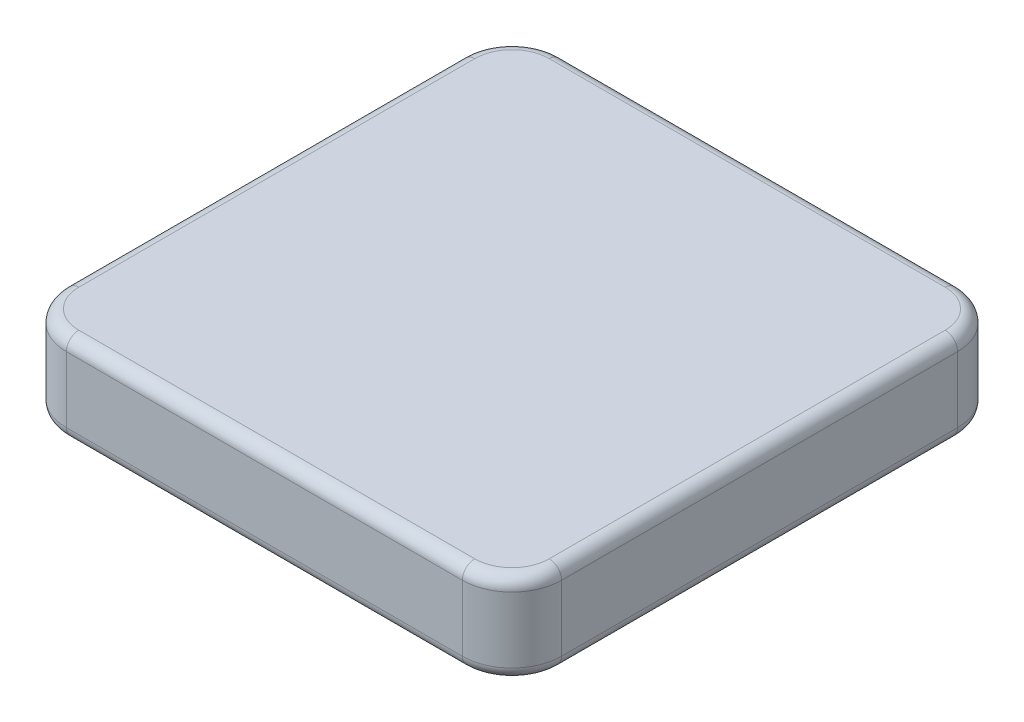
ISO-10303-21;
HEADER;
FILE_DESCRIPTION(('STEP AP214'),'2;1');
FILE_NAME('part.step','',(''),(''),'','','');
FILE_SCHEMA(('AUTOMOTIVE_DESIGN { 1 0 10303 214 1 1 1 1 }'));
ENDSEC;
DATA;
#1=APPLICATION_CONTEXT('core data for automotive mechanical design processes');
#2=APPLICATION_PROTOCOL_DEFINITION('international standard','automotive_design',2000,#1);
#3=PRODUCT_CONTEXT('',#1,'mechanical');
#4=PRODUCT('Part','Part','',(#3));
#5=PRODUCT_RELATED_PRODUCT_CATEGORY('part','',(#4));
#6=PRODUCT_DEFINITION_FORMATION('','',#4);
#7=PRODUCT_DEFINITION_CONTEXT('part definition',#1,'design');
#8=PRODUCT_DEFINITION('design','',#6,#7);
#9=PRODUCT_DEFINITION_SHAPE('','',#8);
#10=(LENGTH_UNIT() NAMED_UNIT(*) SI_UNIT(.MILLI.,.METRE.));
#11=(NAMED_UNIT(*) PLANE_ANGLE_UNIT() SI_UNIT($,.RADIAN.));
#12=(NAMED_UNIT(*) SI_UNIT($,.STERADIAN.) SOLID_ANGLE_UNIT());
#13=UNCERTAINTY_MEASURE_WITH_UNIT(LENGTH_MEASURE(1.E-05),#10,'distance_accuracy_value','');
#14=(GEOMETRIC_REPRESENTATION_CONTEXT(3) GLOBAL_UNCERTAINTY_ASSIGNED_CONTEXT((#13)) GLOBAL_UNIT_ASSIGNED_CONTEXT((#10,
#11,#12)) REPRESENTATION_CONTEXT('',''));
#15=CARTESIAN_POINT('',(0.,0.,0.));
#16=DIRECTION('',(0.,0.,1.));
#17=DIRECTION('',(1.,0.,0.));
#18=AXIS2_PLACEMENT_3D('',#15,#16,#17);
#19=CARTESIAN_POINT('',(4.,7.3,-4.));
#20=DIRECTION('',(0.,-1.,0.));
#21=DIRECTION('',(0.,0.,-1.));
#22=AXIS2_PLACEMENT_3D('',#19,#20,#21);
#23=CYLINDRICAL_SURFACE('',#22,4.);
#24=DIRECTION('',(0.,-1.,0.));
#25=VECTOR('',#24,1.);
#26=CARTESIAN_POINT('',(4.00000000000003,7.3,0.));
#27=LINE('',#26,#25);
#28=CARTESIAN_POINT('',(4.00000000000003,6.3,0.));
#29=VERTEX_POINT('',#28);
#30=CARTESIAN_POINT('',(4.00000000000003,1.,0.));
#31=VERTEX_POINT('',#30);
#32=EDGE_CURVE('E176',#29,#31,#27,.T.);
#33=ORIENTED_EDGE('',*,*,#32,.F.);
#34=CARTESIAN_POINT('',(4.,6.3,-4.));
#35=DIRECTION('',(0.,1.,0.));
#36=DIRECTION('',(0.,0.,1.));
#37=AXIS2_PLACEMENT_3D('',#34,#35,#36);
#38=CIRCLE('',#37,4.);
#39=CARTESIAN_POINT('',(0.,6.3,-4.00000000000003));
#40=VERTEX_POINT('',#39);
#41=EDGE_CURVE('E217',#29,#40,#38,.F.);
#42=ORIENTED_EDGE('',*,*,#41,.T.);
#43=DIRECTION('',(0.,-1.,0.));
#44=VECTOR('',#43,1.);
#45=CARTESIAN_POINT('',(0.,7.3,-4.00000000000003));
#46=LINE('',#45,#44);
#47=CARTESIAN_POINT('',(0.,1.,-4.00000000000003));
#48=VERTEX_POINT('',#47);
#49=EDGE_CURVE('E248',#40,#48,#46,.T.);
#50=ORIENTED_EDGE('',*,*,#49,.T.);
#51=CARTESIAN_POINT('',(4.,1.,-4.));
#52=DIRECTION('',(0.,1.,0.));
#53=DIRECTION('',(0.,0.,1.));
#54=AXIS2_PLACEMENT_3D('',#51,#52,#53);
#55=CIRCLE('',#54,4.);
#56=EDGE_CURVE('E215',#48,#31,#55,.T.);
#57=ORIENTED_EDGE('',*,*,#56,.T.);
#58=EDGE_LOOP('',(#33,#42,#50,#57));
#59=FACE_BOUND('',#58,.T.);
#60=ADVANCED_FACE('F43',(#59),#23,.T.);
#61=CARTESIAN_POINT('',(4.00000000000003,7.3,0.));
#62=DIRECTION('',(0.,0.,-1.));
#63=DIRECTION('',(-1.,0.,0.));
#64=AXIS2_PLACEMENT_3D('',#61,#62,#63);
#65=PLANE('',#64);
#66=DIRECTION('',(0.,-1.,0.));
#67=VECTOR('',#66,1.);
#68=CARTESIAN_POINT('',(35.9,7.3,0.));
#69=LINE('',#68,#67);
#70=CARTESIAN_POINT('',(35.9,6.3,0.));
#71=VERTEX_POINT('',#70);
#72=CARTESIAN_POINT('',(35.9,1.,0.));
#73=VERTEX_POINT('',#72);
#74=EDGE_CURVE('E303',#71,#73,#69,.T.);
#75=ORIENTED_EDGE('',*,*,#74,.F.);
#76=DIRECTION('',(1.,0.,0.));
#77=VECTOR('',#76,1.);
#78=CARTESIAN_POINT('',(4.00000000000003,6.3,0.));
#79=LINE('',#78,#77);
#80=EDGE_CURVE('E213',#71,#29,#79,.F.);
#81=ORIENTED_EDGE('',*,*,#80,.T.);
#82=ORIENTED_EDGE('',*,*,#32,.T.);
#83=DIRECTION('',(1.,0.,0.));
#84=VECTOR('',#83,1.);
#85=CARTESIAN_POINT('',(4.00000000000003,1.,0.));
#86=LINE('',#85,#84);
#87=EDGE_CURVE('E210',#31,#73,#86,.T.);
#88=ORIENTED_EDGE('',*,*,#87,.T.);
#89=EDGE_LOOP('',(#75,#81,#82,#88));
#90=FACE_BOUND('',#89,.T.);
#91=ADVANCED_FACE('F300',(#90),#65,.F.);
#92=CARTESIAN_POINT('',(35.9,7.3,-4.));
#93=DIRECTION('',(0.,-1.,0.));
#94=DIRECTION('',(0.,0.,-1.));
#95=AXIS2_PLACEMENT_3D('',#92,#93,#94);
#96=CYLINDRICAL_SURFACE('',#95,4.);
#97=DIRECTION('',(0.,-1.,0.));
#98=VECTOR('',#97,1.);
#99=CARTESIAN_POINT('',(39.9,7.3,-4.));
#100=LINE('',#99,#98);
#101=CARTESIAN_POINT('',(39.9,6.3,-4.));
#102=VERTEX_POINT('',#101);
#103=CARTESIAN_POINT('',(39.9,1.,-4.));
#104=VERTEX_POINT('',#103);
#105=EDGE_CURVE('E305',#102,#104,#100,.T.);
#106=ORIENTED_EDGE('',*,*,#105,.F.);
#107=CARTESIAN_POINT('',(35.9,6.3,-4.));
#108=DIRECTION('',(0.,1.,0.));
#109=DIRECTION('',(0.,0.,1.));
#110=AXIS2_PLACEMENT_3D('',#107,#108,#109);
#111=CIRCLE('',#110,4.);
#112=EDGE_CURVE('E208',#102,#71,#111,.F.);
#113=ORIENTED_EDGE('',*,*,#112,.T.);
#114=ORIENTED_EDGE('',*,*,#74,.T.);
#115=CARTESIAN_POINT('',(35.9,1.,-4.));
#116=DIRECTION('',(0.,1.,0.));
#117=DIRECTION('',(0.,0.,1.));
#118=AXIS2_PLACEMENT_3D('',#115,#116,#117);
#119=CIRCLE('',#118,4.);
#120=EDGE_CURVE('E206',#73,#104,#119,.T.);
#121=ORIENTED_EDGE('',*,*,#120,.T.);
#122=EDGE_LOOP('',(#106,#113,#114,#121));
#123=FACE_BOUND('',#122,.T.);
#124=ADVANCED_FACE('F373',(#123),#96,.T.);
#125=CARTESIAN_POINT('',(39.9,7.3,-4.));
#126=DIRECTION('',(-1.,0.,0.));
#127=DIRECTION('',(0.,0.,1.));
#128=AXIS2_PLACEMENT_3D('',#125,#126,#127);
#129=PLANE('',#128);
#130=DIRECTION('',(0.,-1.,0.));
#131=VECTOR('',#130,1.);
#132=CARTESIAN_POINT('',(39.9,7.3,-35.9));
#133=LINE('',#132,#131);
#134=CARTESIAN_POINT('',(39.9,6.3,-35.9));
#135=VERTEX_POINT('',#134);
#136=CARTESIAN_POINT('',(39.9,1.,-35.9));
#137=VERTEX_POINT('',#136);
#138=EDGE_CURVE('E342',#135,#137,#133,.T.);
#139=ORIENTED_EDGE('',*,*,#138,.F.);
#140=DIRECTION('',(0.,0.,-1.));
#141=VECTOR('',#140,1.);
#142=CARTESIAN_POINT('',(39.9,6.3,-4.));
#143=LINE('',#142,#141);
#144=EDGE_CURVE('E204',#135,#102,#143,.F.);
#145=ORIENTED_EDGE('',*,*,#144,.T.);
#146=ORIENTED_EDGE('',*,*,#105,.T.);
#147=DIRECTION('',(0.,0.,-1.));
#148=VECTOR('',#147,1.);
#149=CARTESIAN_POINT('',(39.9,1.,-4.));
#150=LINE('',#149,#148);
#151=EDGE_CURVE('E202',#104,#137,#150,.T.);
#152=ORIENTED_EDGE('',*,*,#151,.T.);
#153=EDGE_LOOP('',(#139,#145,#146,#152));
#154=FACE_BOUND('',#153,.T.);
#155=ADVANCED_FACE('F349',(#154),#129,.F.);
#156=CARTESIAN_POINT('',(35.9,7.3,-35.9));
#157=DIRECTION('',(0.,-1.,0.));
#158=DIRECTION('',(0.,0.,-1.));
#159=AXIS2_PLACEMENT_3D('',#156,#157,#158);
#160=CYLINDRICAL_SURFACE('',#159,4.);
#161=DIRECTION('',(0.,-1.,0.));
#162=VECTOR('',#161,1.);
#163=CARTESIAN_POINT('',(35.9,7.3,-39.9));
#164=LINE('',#163,#162);
#165=CARTESIAN_POINT('',(35.9,6.3,-39.9));
#166=VERTEX_POINT('',#165);
#167=CARTESIAN_POINT('',(35.9,1.,-39.9));
#168=VERTEX_POINT('',#167);
#169=EDGE_CURVE('E336',#166,#168,#164,.T.);
#170=ORIENTED_EDGE('',*,*,#169,.F.);
#171=CARTESIAN_POINT('',(35.9,6.3,-35.9));
#172=DIRECTION('',(0.,1.,0.));
#173=DIRECTION('',(0.,0.,1.));
#174=AXIS2_PLACEMENT_3D('',#171,#172,#173);
#175=CIRCLE('',#174,4.);
#176=EDGE_CURVE('E200',#166,#135,#175,.F.);
#177=ORIENTED_EDGE('',*,*,#176,.T.);
#178=ORIENTED_EDGE('',*,*,#138,.T.);
#179=CARTESIAN_POINT('',(35.9,1.,-35.9));
#180=DIRECTION('',(0.,1.,0.));
#181=DIRECTION('',(0.,0.,1.));
#182=AXIS2_PLACEMENT_3D('',#179,#180,#181);
#183=CIRCLE('',#182,4.);
#184=EDGE_CURVE('E198',#137,#168,#183,.T.);
#185=ORIENTED_EDGE('',*,*,#184,.T.);
#186=EDGE_LOOP('',(#170,#177,#178,#185));
#187=FACE_BOUND('',#186,.T.);
#188=ADVANCED_FACE('F412',(#187),#160,.T.);
#189=CARTESIAN_POINT('',(4.,7.3,-39.9));
#190=DIRECTION('',(0.,0.,1.));
#191=DIRECTION('',(1.,0.,0.));
#192=AXIS2_PLACEMENT_3D('',#189,#190,#191);
#193=PLANE('',#192);
#194=DIRECTION('',(0.,-1.,0.));
#195=VECTOR('',#194,1.);
#196=CARTESIAN_POINT('',(4.,7.3,-39.9));
#197=LINE('',#196,#195);
#198=CARTESIAN_POINT('',(4.,6.3,-39.9));
#199=VERTEX_POINT('',#198);
#200=CARTESIAN_POINT('',(4.,1.,-39.9));
#201=VERTEX_POINT('',#200);
#202=EDGE_CURVE('E334',#199,#201,#197,.T.);
#203=ORIENTED_EDGE('',*,*,#202,.F.);
#204=DIRECTION('',(-1.,0.,0.));
#205=VECTOR('',#204,1.);
#206=CARTESIAN_POINT('',(35.9,6.3,-39.9));
#207=LINE('',#206,#205);
#208=EDGE_CURVE('E196',#199,#166,#207,.F.);
#209=ORIENTED_EDGE('',*,*,#208,.T.);
#210=ORIENTED_EDGE('',*,*,#169,.T.);
#211=DIRECTION('',(-1.,0.,0.));
#212=VECTOR('',#211,1.);
#213=CARTESIAN_POINT('',(4.,1.,-39.9));
#214=LINE('',#213,#212);
#215=EDGE_CURVE('E194',#168,#201,#214,.T.);
#216=ORIENTED_EDGE('',*,*,#215,.T.);
#217=EDGE_LOOP('',(#203,#209,#210,#216));
#218=FACE_BOUND('',#217,.T.);
#219=ADVANCED_FACE('F417',(#218),#193,.F.);
#220=CARTESIAN_POINT('',(4.,7.3,-35.9));
#221=DIRECTION('',(0.,-1.,0.));
#222=DIRECTION('',(0.,0.,-1.));
#223=AXIS2_PLACEMENT_3D('',#220,#221,#222);
#224=CYLINDRICAL_SURFACE('',#223,4.);
#225=DIRECTION('',(0.,-1.,0.));
#226=VECTOR('',#225,1.);
#227=CARTESIAN_POINT('',(0.,7.3,-35.9));
#228=LINE('',#227,#226);
#229=CARTESIAN_POINT('',(0.,6.3,-35.9));
#230=VERTEX_POINT('',#229);
#231=CARTESIAN_POINT('',(0.,1.,-35.9));
#232=VERTEX_POINT('',#231);
#233=EDGE_CURVE('E332',#230,#232,#228,.T.);
#234=ORIENTED_EDGE('',*,*,#233,.F.);
#235=CARTESIAN_POINT('',(4.,6.3,-35.9));
#236=DIRECTION('',(0.,1.,0.));
#237=DIRECTION('',(0.,0.,1.));
#238=AXIS2_PLACEMENT_3D('',#235,#236,#237);
#239=CIRCLE('',#238,4.);
#240=EDGE_CURVE('E192',#230,#199,#239,.F.);
#241=ORIENTED_EDGE('',*,*,#240,.T.);
#242=ORIENTED_EDGE('',*,*,#202,.T.);
#243=CARTESIAN_POINT('',(4.,1.,-35.9));
#244=DIRECTION('',(0.,1.,0.));
#245=DIRECTION('',(0.,0.,1.));
#246=AXIS2_PLACEMENT_3D('',#243,#244,#245);
#247=CIRCLE('',#246,4.);
#248=EDGE_CURVE('E190',#201,#232,#247,.T.);
#249=ORIENTED_EDGE('',*,*,#248,.T.);
#250=EDGE_LOOP('',(#234,#241,#242,#249));
#251=FACE_BOUND('',#250,.T.);
#252=ADVANCED_FACE('F333',(#251),#224,.T.);
#253=CARTESIAN_POINT('',(0.,7.3,-4.00000000000003));
#254=DIRECTION('',(1.,0.,0.));
#255=DIRECTION('',(0.,0.,-1.));
#256=AXIS2_PLACEMENT_3D('',#253,#254,#255);
#257=PLANE('',#256);
#258=ORIENTED_EDGE('',*,*,#49,.F.);
#259=DIRECTION('',(0.,0.,1.));
#260=VECTOR('',#259,1.);
#261=CARTESIAN_POINT('',(0.,6.3,-35.9));
#262=LINE('',#261,#260);
#263=EDGE_CURVE('E163',#40,#230,#262,.F.);
#264=ORIENTED_EDGE('',*,*,#263,.T.);
#265=ORIENTED_EDGE('',*,*,#233,.T.);
#266=DIRECTION('',(0.,0.,1.));
#267=VECTOR('',#266,1.);
#268=CARTESIAN_POINT('',(0.,1.,-4.00000000000003));
#269=LINE('',#268,#267);
#270=EDGE_CURVE('E182',#232,#48,#269,.T.);
#271=ORIENTED_EDGE('',*,*,#270,.T.);
#272=EDGE_LOOP('',(#258,#264,#265,#271));
#273=FACE_BOUND('',#272,.T.);
#274=ADVANCED_FACE('F331',(#273),#257,.F.);
#275=CARTESIAN_POINT('',(4.,7.3,-4.));
#276=DIRECTION('',(0.,1.,0.));
#277=DIRECTION('',(0.,0.,1.));
#278=AXIS2_PLACEMENT_3D('',#275,#276,#277);
#279=PLANE('',#278);
#280=CARTESIAN_POINT('',(4.,7.3,-35.9));
#281=DIRECTION('',(0.,1.,0.));
#282=DIRECTION('',(0.,0.,1.));
#283=AXIS2_PLACEMENT_3D('',#280,#281,#282);
#284=CIRCLE('',#283,3.);
#285=CARTESIAN_POINT('',(4.,7.3,-38.9));
#286=VERTEX_POINT('',#285);
#287=CARTESIAN_POINT('',(1.,7.3,-35.9));
#288=VERTEX_POINT('',#287);
#289=EDGE_CURVE('E180',#286,#288,#284,.T.);
#290=ORIENTED_EDGE('',*,*,#289,.T.);
#291=DIRECTION('',(0.,0.,1.));
#292=VECTOR('',#291,1.);
#293=CARTESIAN_POINT('',(1.,7.3,-4.00000000000003));
#294=LINE('',#293,#292);
#295=CARTESIAN_POINT('',(1.,7.3,-4.00000000000003));
#296=VERTEX_POINT('',#295);
#297=EDGE_CURVE('E161',#288,#296,#294,.T.);
#298=ORIENTED_EDGE('',*,*,#297,.T.);
#299=CARTESIAN_POINT('',(4.,7.3,-4.));
#300=DIRECTION('',(0.,1.,0.));
#301=DIRECTION('',(0.,0.,1.));
#302=AXIS2_PLACEMENT_3D('',#299,#300,#301);
#303=CIRCLE('',#302,3.);
#304=CARTESIAN_POINT('',(4.00000000000003,7.3,-1.));
#305=VERTEX_POINT('',#304);
#306=EDGE_CURVE('E169',#296,#305,#303,.T.);
#307=ORIENTED_EDGE('',*,*,#306,.T.);
#308=DIRECTION('',(1.,0.,0.));
#309=VECTOR('',#308,1.);
#310=CARTESIAN_POINT('',(35.9,7.3,-1.));
#311=LINE('',#310,#309);
#312=CARTESIAN_POINT('',(35.9,7.3,-1.));
#313=VERTEX_POINT('',#312);
#314=EDGE_CURVE('E175',#305,#313,#311,.T.);
#315=ORIENTED_EDGE('',*,*,#314,.T.);
#316=CARTESIAN_POINT('',(35.9,7.3,-4.));
#317=DIRECTION('',(0.,1.,0.));
#318=DIRECTION('',(0.,0.,1.));
#319=AXIS2_PLACEMENT_3D('',#316,#317,#318);
#320=CIRCLE('',#319,3.);
#321=CARTESIAN_POINT('',(38.9,7.3,-4.));
#322=VERTEX_POINT('',#321);
#323=EDGE_CURVE('E310',#313,#322,#320,.T.);
#324=ORIENTED_EDGE('',*,*,#323,.T.);
#325=DIRECTION('',(0.,0.,-1.));
#326=VECTOR('',#325,1.);
#327=CARTESIAN_POINT('',(38.9,7.3,-35.9));
#328=LINE('',#327,#326);
#329=CARTESIAN_POINT('',(38.9,7.3,-35.9));
#330=VERTEX_POINT('',#329);
#331=EDGE_CURVE('E312',#322,#330,#328,.T.);
#332=ORIENTED_EDGE('',*,*,#331,.T.);
#333=CARTESIAN_POINT('',(35.9,7.3,-35.9));
#334=DIRECTION('',(0.,1.,0.));
#335=DIRECTION('',(0.,0.,1.));
#336=AXIS2_PLACEMENT_3D('',#333,#334,#335);
#337=CIRCLE('',#336,3.);
#338=CARTESIAN_POINT('',(35.9,7.3,-38.9));
#339=VERTEX_POINT('',#338);
#340=EDGE_CURVE('E314',#330,#339,#337,.T.);
#341=ORIENTED_EDGE('',*,*,#340,.T.);
#342=DIRECTION('',(-1.,0.,0.));
#343=VECTOR('',#342,1.);
#344=CARTESIAN_POINT('',(4.,7.3,-38.9));
#345=LINE('',#344,#343);
#346=EDGE_CURVE('E185',#339,#286,#345,.T.);
#347=ORIENTED_EDGE('',*,*,#346,.T.);
#348=EDGE_LOOP('',(#290,#298,#307,#315,#324,#332,#341,#347));
#349=FACE_BOUND('',#348,.T.);
#350=ADVANCED_FACE('F178',(#349),#279,.T.);
#351=CARTESIAN_POINT('',(4.,0.,-4.));
#352=DIRECTION('',(0.,1.,0.));
#353=DIRECTION('',(0.,0.,1.));
#354=AXIS2_PLACEMENT_3D('',#351,#352,#353);
#355=PLANE('',#354);
#356=CARTESIAN_POINT('',(35.9,0.,-4.));
#357=DIRECTION('',(0.,1.,0.));
#358=DIRECTION('',(0.,0.,1.));
#359=AXIS2_PLACEMENT_3D('',#356,#357,#358);
#360=CIRCLE('',#359,3.);
#361=CARTESIAN_POINT('',(38.9,0.,-4.));
#362=VERTEX_POINT('',#361);
#363=CARTESIAN_POINT('',(35.9,0.,-0.999999999999998));
#364=VERTEX_POINT('',#363);
#365=EDGE_CURVE('E52',#362,#364,#360,.F.);
#366=ORIENTED_EDGE('',*,*,#365,.T.);
#367=DIRECTION('',(1.,0.,0.));
#368=VECTOR('',#367,1.);
#369=CARTESIAN_POINT('',(4.,0.,-1.));
#370=LINE('',#369,#368);
#371=CARTESIAN_POINT('',(4.00000000000003,0.,-1.));
#372=VERTEX_POINT('',#371);
#373=EDGE_CURVE('E11',#364,#372,#370,.F.);
#374=ORIENTED_EDGE('',*,*,#373,.T.);
#375=CARTESIAN_POINT('',(4.,0.,-4.));
#376=DIRECTION('',(0.,1.,0.));
#377=DIRECTION('',(0.,0.,1.));
#378=AXIS2_PLACEMENT_3D('',#375,#376,#377);
#379=CIRCLE('',#378,3.);
#380=CARTESIAN_POINT('',(1.,0.,-4.00000000000003));
#381=VERTEX_POINT('',#380);
#382=EDGE_CURVE('E219',#372,#381,#379,.F.);
#383=ORIENTED_EDGE('',*,*,#382,.T.);
#384=DIRECTION('',(0.,0.,1.));
#385=VECTOR('',#384,1.);
#386=CARTESIAN_POINT('',(1.,0.,-4.));
#387=LINE('',#386,#385);
#388=CARTESIAN_POINT('',(1.,0.,-35.9));
#389=VERTEX_POINT('',#388);
#390=EDGE_CURVE('E221',#381,#389,#387,.F.);
#391=ORIENTED_EDGE('',*,*,#390,.T.);
#392=CARTESIAN_POINT('',(4.,0.,-35.9));
#393=DIRECTION('',(0.,1.,0.));
#394=DIRECTION('',(0.,0.,1.));
#395=AXIS2_PLACEMENT_3D('',#392,#393,#394);
#396=CIRCLE('',#395,3.);
#397=CARTESIAN_POINT('',(4.,0.,-38.9));
#398=VERTEX_POINT('',#397);
#399=EDGE_CURVE('E223',#389,#398,#396,.F.);
#400=ORIENTED_EDGE('',*,*,#399,.T.);
#401=DIRECTION('',(-1.,0.,0.));
#402=VECTOR('',#401,1.);
#403=CARTESIAN_POINT('',(4.,0.,-38.9));
#404=LINE('',#403,#402);
#405=CARTESIAN_POINT('',(35.9,0.,-38.9));
#406=VERTEX_POINT('',#405);
#407=EDGE_CURVE('E225',#398,#406,#404,.F.);
#408=ORIENTED_EDGE('',*,*,#407,.T.);
#409=CARTESIAN_POINT('',(35.9,0.,-35.9));
#410=DIRECTION('',(0.,1.,0.));
#411=DIRECTION('',(0.,0.,1.));
#412=AXIS2_PLACEMENT_3D('',#409,#410,#411);
#413=CIRCLE('',#412,3.);
#414=CARTESIAN_POINT('',(38.9,0.,-35.9));
#415=VERTEX_POINT('',#414);
#416=EDGE_CURVE('E227',#406,#415,#413,.F.);
#417=ORIENTED_EDGE('',*,*,#416,.T.);
#418=DIRECTION('',(0.,0.,-1.));
#419=VECTOR('',#418,1.);
#420=CARTESIAN_POINT('',(38.9,0.,-3.99999999999999));
#421=LINE('',#420,#419);
#422=EDGE_CURVE('E63',#415,#362,#421,.F.);
#423=ORIENTED_EDGE('',*,*,#422,.T.);
#424=EDGE_LOOP('',(#366,#374,#383,#391,#400,#408,#417,#423));
#425=FACE_BOUND('',#424,.T.);
#426=ADVANCED_FACE('F280',(#425),#355,.F.);
#427=CARTESIAN_POINT('',(38.9,6.3,-3.99999999999999));
#428=DIRECTION('',(0.,0.,1.));
#429=DIRECTION('',(1.,0.,0.));
#430=AXIS2_PLACEMENT_3D('',#427,#428,#429);
#431=CYLINDRICAL_SURFACE('',#430,1.);
#432=CARTESIAN_POINT('',(38.9,6.3,-4.));
#433=DIRECTION('',(0.,0.,1.));
#434=DIRECTION('',(1.,0.,0.));
#435=AXIS2_PLACEMENT_3D('',#432,#433,#434);
#436=CIRCLE('',#435,1.);
#437=EDGE_CURVE('E242',#102,#322,#436,.T.);
#438=ORIENTED_EDGE('',*,*,#437,.F.);
#439=ORIENTED_EDGE('',*,*,#144,.F.);
#440=CARTESIAN_POINT('',(38.9,6.3,-35.9));
#441=DIRECTION('',(0.,0.,-1.));
#442=DIRECTION('',(-1.,0.,0.));
#443=AXIS2_PLACEMENT_3D('',#440,#441,#442);
#444=CIRCLE('',#443,1.);
#445=EDGE_CURVE('E245',#330,#135,#444,.T.);
#446=ORIENTED_EDGE('',*,*,#445,.F.);
#447=ORIENTED_EDGE('',*,*,#331,.F.);
#448=EDGE_LOOP('',(#438,#439,#446,#447));
#449=FACE_BOUND('',#448,.T.);
#450=ADVANCED_FACE('F395',(#449),#431,.T.);
#451=CARTESIAN_POINT('',(35.9,6.3,-35.9));
#452=DIRECTION('',(0.,1.,0.));
#453=DIRECTION('',(0.,0.,1.));
#454=AXIS2_PLACEMENT_3D('',#451,#452,#453);
#455=TOROIDAL_SURFACE('',#454,3.,1.);
#456=ORIENTED_EDGE('',*,*,#445,.T.);
#457=ORIENTED_EDGE('',*,*,#176,.F.);
#458=CARTESIAN_POINT('',(35.9,6.3,-38.9));
#459=DIRECTION('',(-1.,0.,0.));
#460=DIRECTION('',(0.,0.,1.));
#461=AXIS2_PLACEMENT_3D('',#458,#459,#460);
#462=CIRCLE('',#461,1.);
#463=EDGE_CURVE('E239',#339,#166,#462,.T.);
#464=ORIENTED_EDGE('',*,*,#463,.F.);
#465=ORIENTED_EDGE('',*,*,#340,.F.);
#466=EDGE_LOOP('',(#456,#457,#464,#465));
#467=FACE_BOUND('',#466,.T.);
#468=ADVANCED_FACE('F392',(#467),#455,.T.);
#469=CARTESIAN_POINT('',(35.9,6.3,-4.));
#470=DIRECTION('',(0.,1.,0.));
#471=DIRECTION('',(0.,0.,1.));
#472=AXIS2_PLACEMENT_3D('',#469,#470,#471);
#473=TOROIDAL_SURFACE('',#472,3.,1.);
#474=ORIENTED_EDGE('',*,*,#437,.T.);
#475=ORIENTED_EDGE('',*,*,#323,.F.);
#476=CARTESIAN_POINT('',(35.9,6.3,-0.999999999999998));
#477=DIRECTION('',(-1.,0.,0.));
#478=DIRECTION('',(0.,0.,1.));
#479=AXIS2_PLACEMENT_3D('',#476,#477,#478);
#480=CIRCLE('',#479,1.);
#481=EDGE_CURVE('E236',#71,#313,#480,.T.);
#482=ORIENTED_EDGE('',*,*,#481,.F.);
#483=ORIENTED_EDGE('',*,*,#112,.F.);
#484=EDGE_LOOP('',(#474,#475,#482,#483));
#485=FACE_BOUND('',#484,.T.);
#486=ADVANCED_FACE('F389',(#485),#473,.T.);
#487=CARTESIAN_POINT('',(4.,6.3,-38.9));
#488=DIRECTION('',(1.,0.,0.));
#489=DIRECTION('',(0.,0.,-1.));
#490=AXIS2_PLACEMENT_3D('',#487,#488,#489);
#491=CYLINDRICAL_SURFACE('',#490,1.);
#492=ORIENTED_EDGE('',*,*,#463,.T.);
#493=ORIENTED_EDGE('',*,*,#208,.F.);
#494=CARTESIAN_POINT('',(4.,6.3,-38.9));
#495=DIRECTION('',(-1.,0.,0.));
#496=DIRECTION('',(0.,0.,1.));
#497=AXIS2_PLACEMENT_3D('',#494,#495,#496);
#498=CIRCLE('',#497,1.);
#499=EDGE_CURVE('E233',#286,#199,#498,.T.);
#500=ORIENTED_EDGE('',*,*,#499,.F.);
#501=ORIENTED_EDGE('',*,*,#346,.F.);
#502=EDGE_LOOP('',(#492,#493,#500,#501));
#503=FACE_BOUND('',#502,.T.);
#504=ADVANCED_FACE('F321',(#503),#491,.T.);
#505=CARTESIAN_POINT('',(4.,6.3,-1.));
#506=DIRECTION('',(-1.,0.,0.));
#507=DIRECTION('',(0.,0.,1.));
#508=AXIS2_PLACEMENT_3D('',#505,#506,#507);
#509=CYLINDRICAL_SURFACE('',#508,1.);
#510=ORIENTED_EDGE('',*,*,#481,.T.);
#511=ORIENTED_EDGE('',*,*,#314,.F.);
#512=CARTESIAN_POINT('',(4.00000000000003,6.3,-1.));
#513=DIRECTION('',(-1.,0.,0.));
#514=DIRECTION('',(0.,0.,1.));
#515=AXIS2_PLACEMENT_3D('',#512,#513,#514);
#516=CIRCLE('',#515,1.);
#517=EDGE_CURVE('E172',#29,#305,#516,.T.);
#518=ORIENTED_EDGE('',*,*,#517,.F.);
#519=ORIENTED_EDGE('',*,*,#80,.F.);
#520=EDGE_LOOP('',(#510,#511,#518,#519));
#521=FACE_BOUND('',#520,.T.);
#522=ADVANCED_FACE('F383',(#521),#509,.T.);
#523=CARTESIAN_POINT('',(4.,6.3,-35.9));
#524=DIRECTION('',(0.,1.,0.));
#525=DIRECTION('',(0.,0.,1.));
#526=AXIS2_PLACEMENT_3D('',#523,#524,#525);
#527=TOROIDAL_SURFACE('',#526,3.,1.);
#528=ORIENTED_EDGE('',*,*,#499,.T.);
#529=ORIENTED_EDGE('',*,*,#240,.F.);
#530=CARTESIAN_POINT('',(1.,6.3,-35.9));
#531=DIRECTION('',(0.,0.,1.));
#532=DIRECTION('',(1.,0.,0.));
#533=AXIS2_PLACEMENT_3D('',#530,#531,#532);
#534=CIRCLE('',#533,1.);
#535=EDGE_CURVE('E166',#288,#230,#534,.T.);
#536=ORIENTED_EDGE('',*,*,#535,.F.);
#537=ORIENTED_EDGE('',*,*,#289,.F.);
#538=EDGE_LOOP('',(#528,#529,#536,#537));
#539=FACE_BOUND('',#538,.T.);
#540=ADVANCED_FACE('F324',(#539),#527,.T.);
#541=CARTESIAN_POINT('',(4.,6.3,-4.));
#542=DIRECTION('',(0.,1.,0.));
#543=DIRECTION('',(0.,0.,1.));
#544=AXIS2_PLACEMENT_3D('',#541,#542,#543);
#545=TOROIDAL_SURFACE('',#544,3.,1.);
#546=ORIENTED_EDGE('',*,*,#517,.T.);
#547=ORIENTED_EDGE('',*,*,#306,.F.);
#548=CARTESIAN_POINT('',(1.,6.3,-4.00000000000002));
#549=DIRECTION('',(0.,0.,-1.));
#550=DIRECTION('',(-1.,0.,0.));
#551=AXIS2_PLACEMENT_3D('',#548,#549,#550);
#552=CIRCLE('',#551,1.);
#553=EDGE_CURVE('E157',#40,#296,#552,.T.);
#554=ORIENTED_EDGE('',*,*,#553,.F.);
#555=ORIENTED_EDGE('',*,*,#41,.F.);
#556=EDGE_LOOP('',(#546,#547,#554,#555));
#557=FACE_BOUND('',#556,.T.);
#558=ADVANCED_FACE('F170',(#557),#545,.T.);
#559=CARTESIAN_POINT('',(1.,6.3,-4.));
#560=DIRECTION('',(0.,0.,-1.));
#561=DIRECTION('',(-1.,0.,0.));
#562=AXIS2_PLACEMENT_3D('',#559,#560,#561);
#563=CYLINDRICAL_SURFACE('',#562,1.);
#564=ORIENTED_EDGE('',*,*,#535,.T.);
#565=ORIENTED_EDGE('',*,*,#263,.F.);
#566=ORIENTED_EDGE('',*,*,#553,.T.);
#567=ORIENTED_EDGE('',*,*,#297,.F.);
#568=EDGE_LOOP('',(#564,#565,#566,#567));
#569=FACE_BOUND('',#568,.T.);
#570=ADVANCED_FACE('F159',(#569),#563,.T.);
#571=CARTESIAN_POINT('',(4.,1.,-38.9));
#572=DIRECTION('',(-1.,0.,0.));
#573=DIRECTION('',(0.,0.,1.));
#574=AXIS2_PLACEMENT_3D('',#571,#572,#573);
#575=CYLINDRICAL_SURFACE('',#574,1.);
#576=CARTESIAN_POINT('',(35.9,1.,-38.9));
#577=DIRECTION('',(1.,0.,0.));
#578=DIRECTION('',(0.,0.,-1.));
#579=AXIS2_PLACEMENT_3D('',#576,#577,#578);
#580=CIRCLE('',#579,1.);
#581=EDGE_CURVE('E264',#406,#168,#580,.T.);
#582=ORIENTED_EDGE('',*,*,#581,.F.);
#583=ORIENTED_EDGE('',*,*,#407,.F.);
#584=CARTESIAN_POINT('',(4.,1.,-38.9));
#585=DIRECTION('',(-1.,0.,0.));
#586=DIRECTION('',(0.,0.,1.));
#587=AXIS2_PLACEMENT_3D('',#584,#585,#586);
#588=CIRCLE('',#587,1.);
#589=EDGE_CURVE('E47',#201,#398,#588,.T.);
#590=ORIENTED_EDGE('',*,*,#589,.F.);
#591=ORIENTED_EDGE('',*,*,#215,.F.);
#592=EDGE_LOOP('',(#582,#583,#590,#591));
#593=FACE_BOUND('',#592,.T.);
#594=ADVANCED_FACE('F45',(#593),#575,.T.);
#595=CARTESIAN_POINT('',(4.,1.,-35.9));
#596=DIRECTION('',(0.,1.,0.));
#597=DIRECTION('',(0.,0.,1.));
#598=AXIS2_PLACEMENT_3D('',#595,#596,#597);
#599=TOROIDAL_SURFACE('',#598,3.,1.);
#600=ORIENTED_EDGE('',*,*,#589,.T.);
#601=ORIENTED_EDGE('',*,*,#399,.F.);
#602=CARTESIAN_POINT('',(1.,1.,-35.9));
#603=DIRECTION('',(0.,0.,1.));
#604=DIRECTION('',(1.,0.,0.));
#605=AXIS2_PLACEMENT_3D('',#602,#603,#604);
#606=CIRCLE('',#605,1.);
#607=EDGE_CURVE('E262',#232,#389,#606,.T.);
#608=ORIENTED_EDGE('',*,*,#607,.F.);
#609=ORIENTED_EDGE('',*,*,#248,.F.);
#610=EDGE_LOOP('',(#600,#601,#608,#609));
#611=FACE_BOUND('',#610,.T.);
#612=ADVANCED_FACE('F275',(#611),#599,.T.);
#613=CARTESIAN_POINT('',(35.9,1.,-35.9));
#614=DIRECTION('',(0.,1.,0.));
#615=DIRECTION('',(0.,0.,1.));
#616=AXIS2_PLACEMENT_3D('',#613,#614,#615);
#617=TOROIDAL_SURFACE('',#616,3.,1.);
#618=ORIENTED_EDGE('',*,*,#581,.T.);
#619=ORIENTED_EDGE('',*,*,#184,.F.);
#620=CARTESIAN_POINT('',(38.9,1.,-35.9));
#621=DIRECTION('',(0.,0.,1.));
#622=DIRECTION('',(1.,0.,0.));
#623=AXIS2_PLACEMENT_3D('',#620,#621,#622);
#624=CIRCLE('',#623,1.);
#625=EDGE_CURVE('E259',#415,#137,#624,.T.);
#626=ORIENTED_EDGE('',*,*,#625,.F.);
#627=ORIENTED_EDGE('',*,*,#416,.F.);
#628=EDGE_LOOP('',(#618,#619,#626,#627));
#629=FACE_BOUND('',#628,.T.);
#630=ADVANCED_FACE('F497',(#629),#617,.T.);
#631=CARTESIAN_POINT('',(1.,1.,-4.00000000000003));
#632=DIRECTION('',(0.,0.,1.));
#633=DIRECTION('',(1.,0.,0.));
#634=AXIS2_PLACEMENT_3D('',#631,#632,#633);
#635=CYLINDRICAL_SURFACE('',#634,1.);
#636=ORIENTED_EDGE('',*,*,#607,.T.);
#637=ORIENTED_EDGE('',*,*,#390,.F.);
#638=CARTESIAN_POINT('',(1.,1.,-4.00000000000003));
#639=DIRECTION('',(0.,0.,1.));
#640=DIRECTION('',(1.,0.,0.));
#641=AXIS2_PLACEMENT_3D('',#638,#639,#640);
#642=CIRCLE('',#641,1.);
#643=EDGE_CURVE('E256',#48,#381,#642,.T.);
#644=ORIENTED_EDGE('',*,*,#643,.F.);
#645=ORIENTED_EDGE('',*,*,#270,.F.);
#646=EDGE_LOOP('',(#636,#637,#644,#645));
#647=FACE_BOUND('',#646,.T.);
#648=ADVANCED_FACE('F286',(#647),#635,.T.);
#649=CARTESIAN_POINT('',(38.9,1.,-4.));
#650=DIRECTION('',(0.,0.,-1.));
#651=DIRECTION('',(-1.,0.,0.));
#652=AXIS2_PLACEMENT_3D('',#649,#650,#651);
#653=CYLINDRICAL_SURFACE('',#652,1.);
#654=ORIENTED_EDGE('',*,*,#625,.T.);
#655=ORIENTED_EDGE('',*,*,#151,.F.);
#656=CARTESIAN_POINT('',(38.9,1.,-4.));
#657=DIRECTION('',(0.,0.,1.));
#658=DIRECTION('',(1.,0.,0.));
#659=AXIS2_PLACEMENT_3D('',#656,#657,#658);
#660=CIRCLE('',#659,1.);
#661=EDGE_CURVE('E253',#362,#104,#660,.T.);
#662=ORIENTED_EDGE('',*,*,#661,.F.);
#663=ORIENTED_EDGE('',*,*,#422,.F.);
#664=EDGE_LOOP('',(#654,#655,#662,#663));
#665=FACE_BOUND('',#664,.T.);
#666=ADVANCED_FACE('F354',(#665),#653,.T.);
#667=CARTESIAN_POINT('',(4.,1.,-4.));
#668=DIRECTION('',(0.,1.,0.));
#669=DIRECTION('',(0.,0.,1.));
#670=AXIS2_PLACEMENT_3D('',#667,#668,#669);
#671=TOROIDAL_SURFACE('',#670,3.,1.);
#672=ORIENTED_EDGE('',*,*,#643,.T.);
#673=ORIENTED_EDGE('',*,*,#382,.F.);
#674=CARTESIAN_POINT('',(4.00000000000002,1.,-1.));
#675=DIRECTION('',(1.,0.,0.));
#676=DIRECTION('',(0.,0.,-1.));
#677=AXIS2_PLACEMENT_3D('',#674,#675,#676);
#678=CIRCLE('',#677,1.);
#679=EDGE_CURVE('E251',#31,#372,#678,.T.);
#680=ORIENTED_EDGE('',*,*,#679,.F.);
#681=ORIENTED_EDGE('',*,*,#56,.F.);
#682=EDGE_LOOP('',(#672,#673,#680,#681));
#683=FACE_BOUND('',#682,.T.);
#684=ADVANCED_FACE('F290',(#683),#671,.T.);
#685=CARTESIAN_POINT('',(35.9,1.,-4.));
#686=DIRECTION('',(0.,1.,0.));
#687=DIRECTION('',(0.,0.,1.));
#688=AXIS2_PLACEMENT_3D('',#685,#686,#687);
#689=TOROIDAL_SURFACE('',#688,3.,1.);
#690=ORIENTED_EDGE('',*,*,#661,.T.);
#691=ORIENTED_EDGE('',*,*,#120,.F.);
#692=CARTESIAN_POINT('',(35.9,1.,-0.999999999999998));
#693=DIRECTION('',(-1.,0.,0.));
#694=DIRECTION('',(0.,0.,1.));
#695=AXIS2_PLACEMENT_3D('',#692,#693,#694);
#696=CIRCLE('',#695,1.);
#697=EDGE_CURVE('E249',#364,#73,#696,.T.);
#698=ORIENTED_EDGE('',*,*,#697,.F.);
#699=ORIENTED_EDGE('',*,*,#365,.F.);
#700=EDGE_LOOP('',(#690,#691,#698,#699));
#701=FACE_BOUND('',#700,.T.);
#702=ADVANCED_FACE('F357',(#701),#689,.T.);
#703=CARTESIAN_POINT('',(4.00000000000003,1.,-1.));
#704=DIRECTION('',(1.,0.,0.));
#705=DIRECTION('',(0.,0.,-1.));
#706=AXIS2_PLACEMENT_3D('',#703,#704,#705);
#707=CYLINDRICAL_SURFACE('',#706,1.);
#708=ORIENTED_EDGE('',*,*,#679,.T.);
#709=ORIENTED_EDGE('',*,*,#373,.F.);
#710=ORIENTED_EDGE('',*,*,#697,.T.);
#711=ORIENTED_EDGE('',*,*,#87,.F.);
#712=EDGE_LOOP('',(#708,#709,#710,#711));
#713=FACE_BOUND('',#712,.T.);
#714=ADVANCED_FACE('F360',(#713),#707,.T.);
#715=CLOSED_SHELL('',(#60,#91,#124,#155,#188,#219,#252,#274,#350,#426,#450,#468,#486,#504,#522,
#540,#558,#570,#594,#612,#630,#648,#666,#684,#702,#714));
#716=MANIFOLD_SOLID_BREP('B2',#715);
#717=ADVANCED_BREP_SHAPE_REPRESENTATION('',(#18,#716),#14);
#718=SHAPE_DEFINITION_REPRESENTATION(#9,#717);
ENDSEC;
END-ISO-10303-21;
